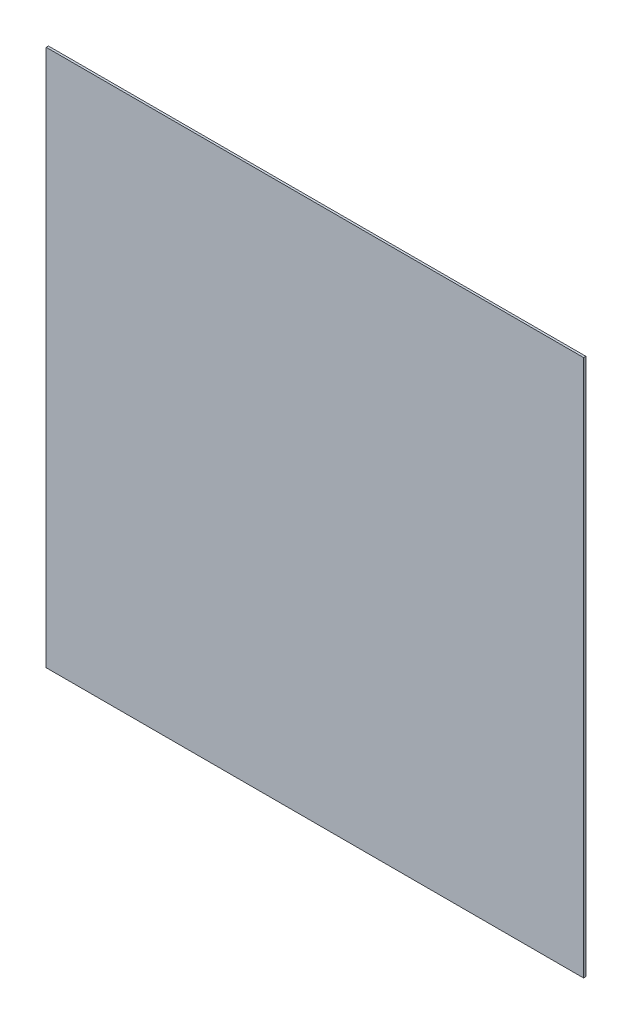
ISO-10303-21;
HEADER;
FILE_DESCRIPTION(('STEP AP214'),'2;1');
FILE_NAME('part.step','',(''),(''),'','','');
FILE_SCHEMA(('AUTOMOTIVE_DESIGN { 1 0 10303 214 1 1 1 1 }'));
ENDSEC;
DATA;
#1=APPLICATION_CONTEXT('core data for automotive mechanical design processes');
#2=APPLICATION_PROTOCOL_DEFINITION('international standard','automotive_design',2000,#1);
#3=PRODUCT_CONTEXT('',#1,'mechanical');
#4=PRODUCT('Part','Part','',(#3));
#5=PRODUCT_RELATED_PRODUCT_CATEGORY('part','',(#4));
#6=PRODUCT_DEFINITION_FORMATION('','',#4);
#7=PRODUCT_DEFINITION_CONTEXT('part definition',#1,'design');
#8=PRODUCT_DEFINITION('design','',#6,#7);
#9=PRODUCT_DEFINITION_SHAPE('','',#8);
#10=(LENGTH_UNIT() NAMED_UNIT(*) SI_UNIT(.MILLI.,.METRE.));
#11=(NAMED_UNIT(*) PLANE_ANGLE_UNIT() SI_UNIT($,.RADIAN.));
#12=(NAMED_UNIT(*) SI_UNIT($,.STERADIAN.) SOLID_ANGLE_UNIT());
#13=UNCERTAINTY_MEASURE_WITH_UNIT(LENGTH_MEASURE(1.E-05),#10,'distance_accuracy_value','');
#14=(GEOMETRIC_REPRESENTATION_CONTEXT(3) GLOBAL_UNCERTAINTY_ASSIGNED_CONTEXT((#13)) GLOBAL_UNIT_ASSIGNED_CONTEXT((#10,
#11,#12)) REPRESENTATION_CONTEXT('',''));
#15=CARTESIAN_POINT('',(0.,0.,0.));
#16=DIRECTION('',(0.,0.,1.));
#17=DIRECTION('',(1.,0.,0.));
#18=AXIS2_PLACEMENT_3D('',#15,#16,#17);
#19=CARTESIAN_POINT('',(0.,0.,3.175));
#20=DIRECTION('',(1.,0.,0.));
#21=DIRECTION('',(0.,0.,-1.));
#22=AXIS2_PLACEMENT_3D('',#19,#20,#21);
#23=PLANE('',#22);
#24=DIRECTION('',(0.,-1.,0.));
#25=VECTOR('',#24,1.);
#26=CARTESIAN_POINT('',(0.,0.,0.));
#27=LINE('',#26,#25);
#28=CARTESIAN_POINT('',(0.,762.,0.));
#29=VERTEX_POINT('',#28);
#30=CARTESIAN_POINT('',(0.,0.,0.));
#31=VERTEX_POINT('',#30);
#32=EDGE_CURVE('E96',#29,#31,#27,.T.);
#33=ORIENTED_EDGE('',*,*,#32,.T.);
#34=DIRECTION('',(0.,0.,-1.));
#35=VECTOR('',#34,1.);
#36=CARTESIAN_POINT('',(0.,0.,3.175));
#37=LINE('',#36,#35);
#38=CARTESIAN_POINT('',(0.,0.,3.175));
#39=VERTEX_POINT('',#38);
#40=EDGE_CURVE('E11',#39,#31,#37,.T.);
#41=ORIENTED_EDGE('',*,*,#40,.F.);
#42=DIRECTION('',(0.,-1.,0.));
#43=VECTOR('',#42,1.);
#44=CARTESIAN_POINT('',(0.,0.,3.175));
#45=LINE('',#44,#43);
#46=CARTESIAN_POINT('',(0.,762.,3.175));
#47=VERTEX_POINT('',#46);
#48=EDGE_CURVE('E84',#47,#39,#45,.T.);
#49=ORIENTED_EDGE('',*,*,#48,.F.);
#50=DIRECTION('',(0.,0.,-1.));
#51=VECTOR('',#50,1.);
#52=CARTESIAN_POINT('',(0.,762.,3.175));
#53=LINE('',#52,#51);
#54=EDGE_CURVE('E92',#47,#29,#53,.T.);
#55=ORIENTED_EDGE('',*,*,#54,.T.);
#56=EDGE_LOOP('',(#33,#41,#49,#55));
#57=FACE_BOUND('',#56,.T.);
#58=ADVANCED_FACE('F33',(#57),#23,.F.);
#59=CARTESIAN_POINT('',(0.,0.,3.175));
#60=DIRECTION('',(0.,1.,0.));
#61=DIRECTION('',(0.,0.,1.));
#62=AXIS2_PLACEMENT_3D('',#59,#60,#61);
#63=PLANE('',#62);
#64=DIRECTION('',(1.,0.,0.));
#65=VECTOR('',#64,1.);
#66=CARTESIAN_POINT('',(0.,0.,0.));
#67=LINE('',#66,#65);
#68=CARTESIAN_POINT('',(762.,0.,0.));
#69=VERTEX_POINT('',#68);
#70=EDGE_CURVE('E88',#31,#69,#67,.T.);
#71=ORIENTED_EDGE('',*,*,#70,.T.);
#72=DIRECTION('',(0.,0.,-1.));
#73=VECTOR('',#72,1.);
#74=CARTESIAN_POINT('',(762.,0.,3.175));
#75=LINE('',#74,#73);
#76=CARTESIAN_POINT('',(762.,0.,3.175));
#77=VERTEX_POINT('',#76);
#78=EDGE_CURVE('E41',#77,#69,#75,.T.);
#79=ORIENTED_EDGE('',*,*,#78,.F.);
#80=DIRECTION('',(1.,0.,0.));
#81=VECTOR('',#80,1.);
#82=CARTESIAN_POINT('',(0.,0.,3.175));
#83=LINE('',#82,#81);
#84=EDGE_CURVE('E79',#39,#77,#83,.T.);
#85=ORIENTED_EDGE('',*,*,#84,.F.);
#86=ORIENTED_EDGE('',*,*,#40,.T.);
#87=EDGE_LOOP('',(#71,#79,#85,#86));
#88=FACE_BOUND('',#87,.T.);
#89=ADVANCED_FACE('F87',(#88),#63,.F.);
#90=CARTESIAN_POINT('',(762.,0.,3.175));
#91=DIRECTION('',(-1.,0.,0.));
#92=DIRECTION('',(0.,0.,1.));
#93=AXIS2_PLACEMENT_3D('',#90,#91,#92);
#94=PLANE('',#93);
#95=DIRECTION('',(0.,1.,0.));
#96=VECTOR('',#95,1.);
#97=CARTESIAN_POINT('',(762.,0.,0.));
#98=LINE('',#97,#96);
#99=CARTESIAN_POINT('',(762.,762.,0.));
#100=VERTEX_POINT('',#99);
#101=EDGE_CURVE('E66',#69,#100,#98,.T.);
#102=ORIENTED_EDGE('',*,*,#101,.T.);
#103=DIRECTION('',(0.,0.,-1.));
#104=VECTOR('',#103,1.);
#105=CARTESIAN_POINT('',(762.,762.,3.175));
#106=LINE('',#105,#104);
#107=CARTESIAN_POINT('',(762.,762.,3.175));
#108=VERTEX_POINT('',#107);
#109=EDGE_CURVE('E89',#108,#100,#106,.T.);
#110=ORIENTED_EDGE('',*,*,#109,.F.);
#111=DIRECTION('',(0.,1.,0.));
#112=VECTOR('',#111,1.);
#113=CARTESIAN_POINT('',(762.,0.,3.175));
#114=LINE('',#113,#112);
#115=EDGE_CURVE('E82',#77,#108,#114,.T.);
#116=ORIENTED_EDGE('',*,*,#115,.F.);
#117=ORIENTED_EDGE('',*,*,#78,.T.);
#118=EDGE_LOOP('',(#102,#110,#116,#117));
#119=FACE_BOUND('',#118,.T.);
#120=ADVANCED_FACE('F90',(#119),#94,.F.);
#121=CARTESIAN_POINT('',(0.,762.,3.175));
#122=DIRECTION('',(0.,-1.,0.));
#123=DIRECTION('',(0.,0.,-1.));
#124=AXIS2_PLACEMENT_3D('',#121,#122,#123);
#125=PLANE('',#124);
#126=DIRECTION('',(-1.,0.,0.));
#127=VECTOR('',#126,1.);
#128=CARTESIAN_POINT('',(0.,762.,0.));
#129=LINE('',#128,#127);
#130=EDGE_CURVE('E72',#100,#29,#129,.T.);
#131=ORIENTED_EDGE('',*,*,#130,.T.);
#132=ORIENTED_EDGE('',*,*,#54,.F.);
#133=DIRECTION('',(-1.,0.,0.));
#134=VECTOR('',#133,1.);
#135=CARTESIAN_POINT('',(0.,762.,3.175));
#136=LINE('',#135,#134);
#137=EDGE_CURVE('E49',#108,#47,#136,.T.);
#138=ORIENTED_EDGE('',*,*,#137,.F.);
#139=ORIENTED_EDGE('',*,*,#109,.T.);
#140=EDGE_LOOP('',(#131,#132,#138,#139));
#141=FACE_BOUND('',#140,.T.);
#142=ADVANCED_FACE('F103',(#141),#125,.F.);
#143=CARTESIAN_POINT('',(0.,0.,3.175));
#144=DIRECTION('',(0.,0.,-1.));
#145=DIRECTION('',(-1.,0.,0.));
#146=AXIS2_PLACEMENT_3D('',#143,#144,#145);
#147=PLANE('',#146);
#148=ORIENTED_EDGE('',*,*,#48,.T.);
#149=ORIENTED_EDGE('',*,*,#84,.T.);
#150=ORIENTED_EDGE('',*,*,#115,.T.);
#151=ORIENTED_EDGE('',*,*,#137,.T.);
#152=EDGE_LOOP('',(#148,#149,#150,#151));
#153=FACE_BOUND('',#152,.T.);
#154=ADVANCED_FACE('F80',(#153),#147,.F.);
#155=CARTESIAN_POINT('',(0.,0.,0.));
#156=DIRECTION('',(0.,0.,-1.));
#157=DIRECTION('',(-1.,0.,0.));
#158=AXIS2_PLACEMENT_3D('',#155,#156,#157);
#159=PLANE('',#158);
#160=ORIENTED_EDGE('',*,*,#32,.F.);
#161=ORIENTED_EDGE('',*,*,#130,.F.);
#162=ORIENTED_EDGE('',*,*,#101,.F.);
#163=ORIENTED_EDGE('',*,*,#70,.F.);
#164=EDGE_LOOP('',(#160,#161,#162,#163));
#165=FACE_BOUND('',#164,.T.);
#166=ADVANCED_FACE('F106',(#165),#159,.T.);
#167=CLOSED_SHELL('',(#58,#89,#120,#142,#154,#166));
#168=MANIFOLD_SOLID_BREP('B2',#167);
#169=ADVANCED_BREP_SHAPE_REPRESENTATION('',(#18,#168),#14);
#170=SHAPE_DEFINITION_REPRESENTATION(#9,#169);
ENDSEC;
END-ISO-10303-21;
